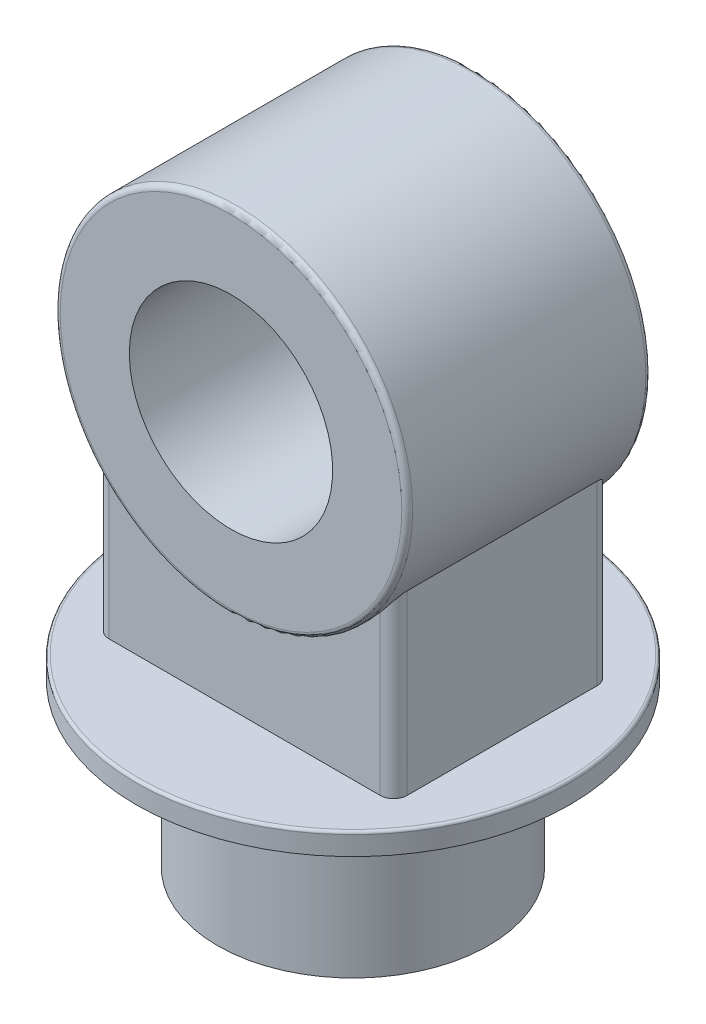
ISO-10303-21;
HEADER;
FILE_DESCRIPTION(('STEP AP214'),'2;1');
FILE_NAME('part.step','',(''),(''),'','','');
FILE_SCHEMA(('AUTOMOTIVE_DESIGN { 1 0 10303 214 1 1 1 1 }'));
ENDSEC;
DATA;
#1=APPLICATION_CONTEXT('core data for automotive mechanical design processes');
#2=APPLICATION_PROTOCOL_DEFINITION('international standard','automotive_design',2000,#1);
#3=PRODUCT_CONTEXT('',#1,'mechanical');
#4=PRODUCT('Part','Part','',(#3));
#5=PRODUCT_RELATED_PRODUCT_CATEGORY('part','',(#4));
#6=PRODUCT_DEFINITION_FORMATION('','',#4);
#7=PRODUCT_DEFINITION_CONTEXT('part definition',#1,'design');
#8=PRODUCT_DEFINITION('design','',#6,#7);
#9=PRODUCT_DEFINITION_SHAPE('','',#8);
#10=(LENGTH_UNIT() NAMED_UNIT(*) SI_UNIT(.MILLI.,.METRE.));
#11=(NAMED_UNIT(*) PLANE_ANGLE_UNIT() SI_UNIT($,.RADIAN.));
#12=(NAMED_UNIT(*) SI_UNIT($,.STERADIAN.) SOLID_ANGLE_UNIT());
#13=UNCERTAINTY_MEASURE_WITH_UNIT(LENGTH_MEASURE(1.E-05),#10,'distance_accuracy_value','');
#14=(GEOMETRIC_REPRESENTATION_CONTEXT(3) GLOBAL_UNCERTAINTY_ASSIGNED_CONTEXT((#13)) GLOBAL_UNIT_ASSIGNED_CONTEXT((#10,
#11,#12)) REPRESENTATION_CONTEXT('',''));
#15=CARTESIAN_POINT('',(0.,0.,0.));
#16=DIRECTION('',(0.,0.,1.));
#17=DIRECTION('',(1.,0.,0.));
#18=AXIS2_PLACEMENT_3D('',#15,#16,#17);
#19=CARTESIAN_POINT('',(0.,120.,0.));
#20=DIRECTION('',(0.,-1.,0.));
#21=DIRECTION('',(0.,0.,-1.));
#22=AXIS2_PLACEMENT_3D('',#19,#20,#21);
#23=CYLINDRICAL_SURFACE('',#22,100.);
#24=CARTESIAN_POINT('',(0.,120.,0.));
#25=DIRECTION('',(0.,1.,0.));
#26=DIRECTION('',(0.,0.,1.));
#27=AXIS2_PLACEMENT_3D('',#24,#25,#26);
#28=CIRCLE('',#27,100.);
#29=CARTESIAN_POINT('',(0.,120.,100.));
#30=VERTEX_POINT('',#29);
#31=EDGE_CURVE('E207',#30,#30,#28,.T.);
#32=ORIENTED_EDGE('',*,*,#31,.F.);
#33=EDGE_LOOP('',(#32));
#34=FACE_BOUND('',#33,.T.);
#35=CARTESIAN_POINT('',(0.,0.,0.));
#36=DIRECTION('',(0.,1.,0.));
#37=DIRECTION('',(0.,0.,1.));
#38=AXIS2_PLACEMENT_3D('',#35,#36,#37);
#39=CIRCLE('',#38,100.);
#40=CARTESIAN_POINT('',(0.,0.,100.));
#41=VERTEX_POINT('',#40);
#42=EDGE_CURVE('E206',#41,#41,#39,.T.);
#43=ORIENTED_EDGE('',*,*,#42,.T.);
#44=EDGE_LOOP('',(#43));
#45=FACE_BOUND('',#44,.T.);
#46=ADVANCED_FACE('F35',(#34,#45),#23,.T.);
#47=CARTESIAN_POINT('',(0.,0.,0.));
#48=DIRECTION('',(0.,1.,0.));
#49=DIRECTION('',(0.,0.,1.));
#50=AXIS2_PLACEMENT_3D('',#47,#48,#49);
#51=PLANE('',#50);
#52=ORIENTED_EDGE('',*,*,#42,.F.);
#53=EDGE_LOOP('',(#52));
#54=FACE_BOUND('',#53,.T.);
#55=ADVANCED_FACE('F242',(#54),#51,.F.);
#56=CARTESIAN_POINT('',(0.,136.,0.));
#57=DIRECTION('',(0.,-1.,0.));
#58=DIRECTION('',(0.,0.,-1.));
#59=AXIS2_PLACEMENT_3D('',#56,#57,#58);
#60=CYLINDRICAL_SURFACE('',#59,160.);
#61=CARTESIAN_POINT('',(0.,134.,0.));
#62=DIRECTION('',(0.,1.,0.));
#63=DIRECTION('',(0.,0.,1.));
#64=AXIS2_PLACEMENT_3D('',#61,#62,#63);
#65=CIRCLE('',#64,160.);
#66=CARTESIAN_POINT('',(0.,134.,160.));
#67=VERTEX_POINT('',#66);
#68=EDGE_CURVE('E215',#67,#67,#65,.F.);
#69=ORIENTED_EDGE('',*,*,#68,.T.);
#70=EDGE_LOOP('',(#69));
#71=FACE_BOUND('',#70,.T.);
#72=CARTESIAN_POINT('',(0.,120.,0.));
#73=DIRECTION('',(0.,1.,0.));
#74=DIRECTION('',(0.,0.,1.));
#75=AXIS2_PLACEMENT_3D('',#72,#73,#74);
#76=CIRCLE('',#75,160.);
#77=CARTESIAN_POINT('',(0.,120.,160.));
#78=VERTEX_POINT('',#77);
#79=EDGE_CURVE('E200',#78,#78,#76,.T.);
#80=ORIENTED_EDGE('',*,*,#79,.T.);
#81=EDGE_LOOP('',(#80));
#82=FACE_BOUND('',#81,.T.);
#83=ADVANCED_FACE('F248',(#71,#82),#60,.T.);
#84=CARTESIAN_POINT('',(0.,136.,0.));
#85=DIRECTION('',(0.,1.,0.));
#86=DIRECTION('',(0.,0.,1.));
#87=AXIS2_PLACEMENT_3D('',#84,#85,#86);
#88=PLANE('',#87);
#89=CARTESIAN_POINT('',(0.,136.,0.));
#90=DIRECTION('',(0.,1.,0.));
#91=DIRECTION('',(0.,0.,1.));
#92=AXIS2_PLACEMENT_3D('',#89,#90,#91);
#93=CIRCLE('',#92,158.);
#94=CARTESIAN_POINT('',(0.,136.,158.));
#95=VERTEX_POINT('',#94);
#96=EDGE_CURVE('E210',#95,#95,#93,.T.);
#97=ORIENTED_EDGE('',*,*,#96,.T.);
#98=EDGE_LOOP('',(#97));
#99=FACE_BOUND('',#98,.T.);
#100=DIRECTION('',(0.,0.,1.));
#101=VECTOR('',#100,1.);
#102=CARTESIAN_POINT('',(-110.,136.,80.));
#103=LINE('',#102,#101);
#104=CARTESIAN_POINT('',(-110.,136.,-69.9999999999999));
#105=VERTEX_POINT('',#104);
#106=CARTESIAN_POINT('',(-110.,136.,70.));
#107=VERTEX_POINT('',#106);
#108=EDGE_CURVE('E385',#105,#107,#103,.T.);
#109=ORIENTED_EDGE('',*,*,#108,.F.);
#110=CARTESIAN_POINT('',(-100.,136.000000000024,-69.9999999999999));
#111=DIRECTION('',(0.,1.,0.));
#112=DIRECTION('',(0.,0.,1.));
#113=AXIS2_PLACEMENT_3D('',#110,#111,#112);
#114=CIRCLE('',#113,10.);
#115=CARTESIAN_POINT('',(-100.,136.,-80.));
#116=VERTEX_POINT('',#115);
#117=EDGE_CURVE('E117',#105,#116,#114,.F.);
#118=ORIENTED_EDGE('',*,*,#117,.T.);
#119=DIRECTION('',(-1.,0.,0.));
#120=VECTOR('',#119,1.);
#121=CARTESIAN_POINT('',(110.,136.,-80.));
#122=LINE('',#121,#120);
#123=CARTESIAN_POINT('',(100.,136.,-80.));
#124=VERTEX_POINT('',#123);
#125=EDGE_CURVE('E384',#124,#116,#122,.T.);
#126=ORIENTED_EDGE('',*,*,#125,.F.);
#127=CARTESIAN_POINT('',(100.,136.000000000024,-70.));
#128=DIRECTION('',(0.,1.,0.));
#129=DIRECTION('',(0.,0.,1.));
#130=AXIS2_PLACEMENT_3D('',#127,#128,#129);
#131=CIRCLE('',#130,10.);
#132=CARTESIAN_POINT('',(110.,136.,-70.));
#133=VERTEX_POINT('',#132);
#134=EDGE_CURVE('E55',#124,#133,#131,.F.);
#135=ORIENTED_EDGE('',*,*,#134,.T.);
#136=DIRECTION('',(0.,0.,-1.));
#137=VECTOR('',#136,1.);
#138=CARTESIAN_POINT('',(110.,136.,80.));
#139=LINE('',#138,#137);
#140=CARTESIAN_POINT('',(110.,136.,70.));
#141=VERTEX_POINT('',#140);
#142=EDGE_CURVE('E184',#141,#133,#139,.T.);
#143=ORIENTED_EDGE('',*,*,#142,.F.);
#144=CARTESIAN_POINT('',(100.,136.000000000024,70.));
#145=DIRECTION('',(0.,1.,0.));
#146=DIRECTION('',(0.,0.,1.));
#147=AXIS2_PLACEMENT_3D('',#144,#145,#146);
#148=CIRCLE('',#147,10.);
#149=CARTESIAN_POINT('',(100.,136.,80.));
#150=VERTEX_POINT('',#149);
#151=EDGE_CURVE('E48',#141,#150,#148,.F.);
#152=ORIENTED_EDGE('',*,*,#151,.T.);
#153=DIRECTION('',(1.,0.,0.));
#154=VECTOR('',#153,1.);
#155=CARTESIAN_POINT('',(110.,136.,80.));
#156=LINE('',#155,#154);
#157=CARTESIAN_POINT('',(-100.,136.,80.));
#158=VERTEX_POINT('',#157);
#159=EDGE_CURVE('E128',#158,#150,#156,.T.);
#160=ORIENTED_EDGE('',*,*,#159,.F.);
#161=CARTESIAN_POINT('',(-100.,136.000000000024,70.));
#162=DIRECTION('',(0.,1.,0.));
#163=DIRECTION('',(0.,0.,1.));
#164=AXIS2_PLACEMENT_3D('',#161,#162,#163);
#165=CIRCLE('',#164,10.);
#166=EDGE_CURVE('E116',#158,#107,#165,.F.);
#167=ORIENTED_EDGE('',*,*,#166,.T.);
#168=EDGE_LOOP('',(#109,#118,#126,#135,#143,#152,#160,#167));
#169=FACE_BOUND('',#168,.T.);
#170=ADVANCED_FACE('F183',(#99,#169),#88,.T.);
#171=CARTESIAN_POINT('',(0.,120.,0.));
#172=DIRECTION('',(0.,1.,0.));
#173=DIRECTION('',(0.,0.,1.));
#174=AXIS2_PLACEMENT_3D('',#171,#172,#173);
#175=PLANE('',#174);
#176=ORIENTED_EDGE('',*,*,#31,.T.);
#177=EDGE_LOOP('',(#176));
#178=FACE_BOUND('',#177,.T.);
#179=ORIENTED_EDGE('',*,*,#79,.F.);
#180=EDGE_LOOP('',(#179));
#181=FACE_BOUND('',#180,.T.);
#182=ADVANCED_FACE('F269',(#178,#181),#175,.F.);
#183=CARTESIAN_POINT('',(110.,500000.,80.));
#184=DIRECTION('',(0.,0.,-1.));
#185=DIRECTION('',(-1.,0.,0.));
#186=AXIS2_PLACEMENT_3D('',#183,#184,#185);
#187=PLANE('',#186);
#188=CARTESIAN_POINT('',(0.,336.,80.));
#189=DIRECTION('',(0.,0.,-1.));
#190=DIRECTION('',(-1.,0.,0.));
#191=AXIS2_PLACEMENT_3D('',#188,#189,#190);
#192=CIRCLE('',#191,130.);
#193=CARTESIAN_POINT('',(-100.,252.933761370819,80.));
#194=VERTEX_POINT('',#193);
#195=CARTESIAN_POINT('',(100.,252.933761370819,80.));
#196=VERTEX_POINT('',#195);
#197=EDGE_CURVE('E127',#194,#196,#192,.F.);
#198=ORIENTED_EDGE('',*,*,#197,.F.);
#199=DIRECTION('',(0.,-1.,0.));
#200=VECTOR('',#199,1.);
#201=CARTESIAN_POINT('',(-100.,500000.,80.));
#202=LINE('',#201,#200);
#203=EDGE_CURVE('E143',#194,#158,#202,.T.);
#204=ORIENTED_EDGE('',*,*,#203,.T.);
#205=ORIENTED_EDGE('',*,*,#159,.T.);
#206=DIRECTION('',(0.,-1.,0.));
#207=VECTOR('',#206,1.);
#208=CARTESIAN_POINT('',(100.,500000.,80.));
#209=LINE('',#208,#207);
#210=EDGE_CURVE('E141',#150,#196,#209,.F.);
#211=ORIENTED_EDGE('',*,*,#210,.T.);
#212=EDGE_LOOP('',(#198,#204,#205,#211));
#213=FACE_BOUND('',#212,.T.);
#214=ADVANCED_FACE('F187',(#213),#187,.F.);
#215=CARTESIAN_POINT('',(-110.,500000.,80.));
#216=DIRECTION('',(1.,0.,0.));
#217=DIRECTION('',(0.,0.,-1.));
#218=AXIS2_PLACEMENT_3D('',#215,#216,#217);
#219=PLANE('',#218);
#220=DIRECTION('',(0.,0.,-1.));
#221=VECTOR('',#220,1.);
#222=CARTESIAN_POINT('',(-110.,266.717967697245,90.));
#223=LINE('',#222,#221);
#224=CARTESIAN_POINT('',(-110.,266.717967697245,-69.9999999999999));
#225=VERTEX_POINT('',#224);
#226=CARTESIAN_POINT('',(-110.,266.717967697245,70.0000000000001));
#227=VERTEX_POINT('',#226);
#228=EDGE_CURVE('E109',#225,#227,#223,.F.);
#229=ORIENTED_EDGE('',*,*,#228,.F.);
#230=DIRECTION('',(0.,-1.,0.));
#231=VECTOR('',#230,1.);
#232=CARTESIAN_POINT('',(-110.,500000.,-69.9999999999999));
#233=LINE('',#232,#231);
#234=EDGE_CURVE('E123',#225,#105,#233,.T.);
#235=ORIENTED_EDGE('',*,*,#234,.T.);
#236=ORIENTED_EDGE('',*,*,#108,.T.);
#237=DIRECTION('',(0.,-1.,0.));
#238=VECTOR('',#237,1.);
#239=CARTESIAN_POINT('',(-110.,500000.,70.));
#240=LINE('',#239,#238);
#241=EDGE_CURVE('E126',#107,#227,#240,.F.);
#242=ORIENTED_EDGE('',*,*,#241,.T.);
#243=EDGE_LOOP('',(#229,#235,#236,#242));
#244=FACE_BOUND('',#243,.T.);
#245=ADVANCED_FACE('F121',(#244),#219,.F.);
#246=CARTESIAN_POINT('',(110.,500000.,80.));
#247=DIRECTION('',(-1.,0.,0.));
#248=DIRECTION('',(0.,0.,1.));
#249=AXIS2_PLACEMENT_3D('',#246,#247,#248);
#250=PLANE('',#249);
#251=ORIENTED_EDGE('',*,*,#142,.T.);
#252=DIRECTION('',(0.,-1.,0.));
#253=VECTOR('',#252,1.);
#254=CARTESIAN_POINT('',(110.,500000.,-70.));
#255=LINE('',#254,#253);
#256=CARTESIAN_POINT('',(110.,266.717967697245,-69.9999999999999));
#257=VERTEX_POINT('',#256);
#258=EDGE_CURVE('E148',#133,#257,#255,.F.);
#259=ORIENTED_EDGE('',*,*,#258,.T.);
#260=DIRECTION('',(0.,0.,-1.));
#261=VECTOR('',#260,1.);
#262=CARTESIAN_POINT('',(110.,266.717967697245,90.));
#263=LINE('',#262,#261);
#264=CARTESIAN_POINT('',(110.,266.717967697245,70.));
#265=VERTEX_POINT('',#264);
#266=EDGE_CURVE('E194',#265,#257,#263,.T.);
#267=ORIENTED_EDGE('',*,*,#266,.F.);
#268=DIRECTION('',(0.,-1.,0.));
#269=VECTOR('',#268,1.);
#270=CARTESIAN_POINT('',(110.,500000.,70.));
#271=LINE('',#270,#269);
#272=EDGE_CURVE('E146',#265,#141,#271,.T.);
#273=ORIENTED_EDGE('',*,*,#272,.T.);
#274=EDGE_LOOP('',(#251,#259,#267,#273));
#275=FACE_BOUND('',#274,.T.);
#276=ADVANCED_FACE('F197',(#275),#250,.F.);
#277=CARTESIAN_POINT('',(110.,500000.,-80.));
#278=DIRECTION('',(0.,0.,1.));
#279=DIRECTION('',(1.,0.,0.));
#280=AXIS2_PLACEMENT_3D('',#277,#278,#279);
#281=PLANE('',#280);
#282=ORIENTED_EDGE('',*,*,#125,.T.);
#283=DIRECTION('',(0.,-1.,0.));
#284=VECTOR('',#283,1.);
#285=CARTESIAN_POINT('',(-100.,500000.,-80.));
#286=LINE('',#285,#284);
#287=CARTESIAN_POINT('',(-100.,252.933761370819,-79.9999999999999));
#288=VERTEX_POINT('',#287);
#289=EDGE_CURVE('E134',#116,#288,#286,.F.);
#290=ORIENTED_EDGE('',*,*,#289,.T.);
#291=CARTESIAN_POINT('',(0.,336.,-79.9999999999999));
#292=DIRECTION('',(0.,0.,1.));
#293=DIRECTION('',(1.,0.,0.));
#294=AXIS2_PLACEMENT_3D('',#291,#292,#293);
#295=CIRCLE('',#294,130.);
#296=CARTESIAN_POINT('',(100.,252.933761370819,-79.9999999999999));
#297=VERTEX_POINT('',#296);
#298=EDGE_CURVE('E112',#297,#288,#295,.F.);
#299=ORIENTED_EDGE('',*,*,#298,.F.);
#300=DIRECTION('',(0.,-1.,0.));
#301=VECTOR('',#300,1.);
#302=CARTESIAN_POINT('',(100.,500000.,-80.));
#303=LINE('',#302,#301);
#304=EDGE_CURVE('E131',#297,#124,#303,.T.);
#305=ORIENTED_EDGE('',*,*,#304,.T.);
#306=EDGE_LOOP('',(#282,#290,#299,#305));
#307=FACE_BOUND('',#306,.T.);
#308=ADVANCED_FACE('F281',(#307),#281,.F.);
#309=CARTESIAN_POINT('',(0.,336.,90.));
#310=DIRECTION('',(0.,0.,-1.));
#311=DIRECTION('',(-1.,0.,0.));
#312=AXIS2_PLACEMENT_3D('',#309,#310,#311);
#313=CYLINDRICAL_SURFACE('',#312,130.);
#314=CARTESIAN_POINT('',(0.,336.,-86.));
#315=DIRECTION('',(0.,0.,1.));
#316=DIRECTION('',(1.,0.,0.));
#317=AXIS2_PLACEMENT_3D('',#314,#315,#316);
#318=CIRCLE('',#317,130.);
#319=CARTESIAN_POINT('',(130.,336.,-86.));
#320=VERTEX_POINT('',#319);
#321=EDGE_CURVE('E221',#320,#320,#318,.T.);
#322=ORIENTED_EDGE('',*,*,#321,.T.);
#323=EDGE_LOOP('',(#322));
#324=FACE_BOUND('',#323,.T.);
#325=CARTESIAN_POINT('',(0.,336.,86.));
#326=DIRECTION('',(0.,0.,1.));
#327=DIRECTION('',(1.,0.,0.));
#328=AXIS2_PLACEMENT_3D('',#325,#326,#327);
#329=CIRCLE('',#328,130.);
#330=CARTESIAN_POINT('',(130.,336.,86.));
#331=VERTEX_POINT('',#330);
#332=EDGE_CURVE('E218',#331,#331,#329,.F.);
#333=ORIENTED_EDGE('',*,*,#332,.T.);
#334=EDGE_LOOP('',(#333));
#335=FACE_BOUND('',#334,.T.);
#336=ORIENTED_EDGE('',*,*,#298,.T.);
#337=CARTESIAN_POINT('',(-100.,252.933761370819,-80.));
#338=CARTESIAN_POINT('',(-100.223611151915,253.202952503255,-79.9999830665314));
#339=CARTESIAN_POINT('',(-100.446118360057,253.473036166024,-79.9924995885084));
#340=CARTESIAN_POINT('',(-100.888548742496,254.014496760122,-79.9629173131462));
#341=CARTESIAN_POINT('',(-101.108472043759,254.285873626978,-79.9408192370115));
#342=CARTESIAN_POINT('',(-101.545586290072,254.829711400373,-79.8822979337703));
#343=CARTESIAN_POINT('',(-101.76277446753,255.102173087004,-79.845861238523));
#344=CARTESIAN_POINT('',(-102.193849033468,255.647413797012,-79.7588609087487));
#345=CARTESIAN_POINT('',(-102.407735374993,255.920192824843,-79.7082970735216));
#346=CARTESIAN_POINT('',(-103.048408055095,256.74400885936,-79.5343891784365));
#347=CARTESIAN_POINT('',(-103.469748368072,257.294974230618,-79.3894263280957));
#348=CARTESIAN_POINT('',(-104.088382224678,258.117224843771,-79.1288060997197));
#349=CARTESIAN_POINT('',(-104.292337034927,258.39057162742,-79.0347525474724));
#350=CARTESIAN_POINT('',(-104.695498702643,258.935304765081,-78.8319429710981));
#351=CARTESIAN_POINT('',(-104.894706004332,259.206691300842,-78.7231883289498));
#352=CARTESIAN_POINT('',(-105.336170271764,259.812965668139,-78.4620472638271));
#353=CARTESIAN_POINT('',(-105.577006541077,260.147108038148,-78.3055009036512));
#354=CARTESIAN_POINT('',(-106.04966094987,260.809343252621,-77.9678086263909));
#355=CARTESIAN_POINT('',(-106.281479043935,261.137436066616,-77.7866625854443));
#356=CARTESIAN_POINT('',(-106.734152264033,261.784259610706,-77.3986376161627));
#357=CARTESIAN_POINT('',(-106.955036134368,262.103013877598,-77.1918317878756));
#358=CARTESIAN_POINT('',(-107.384708325122,262.728803605627,-76.7498943920219));
#359=CARTESIAN_POINT('',(-107.593501627276,263.035843875289,-76.5147746155491));
#360=CARTESIAN_POINT('',(-107.921279015409,263.522080966666,-76.1068757916445));
#361=CARTESIAN_POINT('',(-108.044709884718,263.706240813682,-75.9435605188262));
#362=CARTESIAN_POINT('',(-108.284949666933,264.066582834907,-75.6038296157537));
#363=CARTESIAN_POINT('',(-108.401760304956,264.242767084986,-75.4274174262628));
#364=CARTESIAN_POINT('',(-108.627683741988,264.585236991633,-75.0605773993746));
#365=CARTESIAN_POINT('',(-108.736797961361,264.751524473746,-74.8701521613912));
#366=CARTESIAN_POINT('',(-108.945874410432,265.071634412635,-74.4745306992527));
#367=CARTESIAN_POINT('',(-109.04583974995,265.225461102935,-74.2693395369045));
#368=CARTESIAN_POINT('',(-109.274660386151,265.579056080623,-73.7536743100227));
#369=CARTESIAN_POINT('',(-109.398046362816,265.771031349643,-73.4351396850742));
#370=CARTESIAN_POINT('',(-109.561336457207,266.026263049992,-72.9345418523035));
#371=CARTESIAN_POINT('',(-109.612072269395,266.105785634321,-72.7641622498836));
#372=CARTESIAN_POINT('',(-109.705421847597,266.25239837099,-72.4160328323222));
#373=CARTESIAN_POINT('',(-109.748040656091,266.319496241142,-72.2382876769632));
#374=CARTESIAN_POINT('',(-109.820262744001,266.433384610412,-71.8947331689276));
#375=CARTESIAN_POINT('',(-109.850752312767,266.481551609067,-71.729567610939));
#376=CARTESIAN_POINT('',(-109.903691363628,266.565274678988,-71.3948451418075));
#377=CARTESIAN_POINT('',(-109.926143541964,266.600834979285,-71.2252897238032));
#378=CARTESIAN_POINT('',(-109.962659042777,266.658707696818,-70.8807814271976));
#379=CARTESIAN_POINT('',(-109.976613864032,266.680848750137,-70.7057875562756));
#380=CARTESIAN_POINT('',(-109.99061964662,266.703076138542,-70.4419386674802));
#381=CARTESIAN_POINT('',(-109.99413386492,266.708654625171,-70.353690213971));
#382=CARTESIAN_POINT('',(-109.998824989492,266.716102079045,-70.1769662160101));
#383=CARTESIAN_POINT('',(-110.000001659485,266.717970671296,-70.0884906495069));
#384=CARTESIAN_POINT('',(-110.,266.717967697245,-69.9999999999999));
#385=B_SPLINE_CURVE_WITH_KNOTS('',3,(#337,#338,#339,#340,#341,#342,#343,#344,#345,#346,#347,
#348,#349,#350,#351,#352,#353,#354,#355,#356,#357,#358,#359,#360,#361,#362,#363,#364,#365,#366,
#367,#368,#369,#370,#371,#372,#373,#374,#375,#376,#377,#378,#379,#380,#381,#382,#383,#384),
.UNSPECIFIED.,.F.,.F.,(4,2,2,2,2,2,2,2,2,2,2,2,2,2,2,2,2,2,2,2,2,2,2,4),(0.,1.04974156507771,
2.09943133114567,3.15010942417266,4.20080244462031,6.32356278933855,7.38465211465323,
8.44564176134495,9.76677685539392,11.0879186017609,12.4053795382949,13.7222937149077,
14.5479419827463,15.3733741023697,16.1986534888325,17.0236513022889,18.1946866504919,
18.7783719827904,19.3616935243415,19.8852298594992,20.408590403038,20.9385006934629,
21.2038887699912,21.4693036704869),.UNSPECIFIED.);
#386=EDGE_CURVE('E106',#288,#225,#385,.T.);
#387=ORIENTED_EDGE('',*,*,#386,.T.);
#388=ORIENTED_EDGE('',*,*,#228,.T.);
#389=CARTESIAN_POINT('',(-110.,266.717967697245,70.));
#390=CARTESIAN_POINT('',(-110.000033683462,266.718025852698,70.1614230595313));
#391=CARTESIAN_POINT('',(-109.996092792414,266.711764254296,70.3228118197691));
#392=CARTESIAN_POINT('',(-109.980519982779,266.687045880384,70.6441123999958));
#393=CARTESIAN_POINT('',(-109.968896213713,266.668602027069,70.8040256031146));
#394=CARTESIAN_POINT('',(-109.938376398954,266.620217986395,71.1196424551221));
#395=CARTESIAN_POINT('',(-109.919558261622,266.590400967593,71.2753727040436));
#396=CARTESIAN_POINT('',(-109.875071558334,266.52000006118,71.5834085562727));
#397=CARTESIAN_POINT('',(-109.849400846184,266.479412800404,71.735713070425));
#398=CARTESIAN_POINT('',(-109.784772267017,266.377386983169,72.0722520040975));
#399=CARTESIAN_POINT('',(-109.744103525393,266.313281105856,72.2553511890568));
#400=CARTESIAN_POINT('',(-109.654040532803,266.17165023193,72.6141464391851));
#401=CARTESIAN_POINT('',(-109.604640075501,266.094115691273,72.7898371277865));
#402=CARTESIAN_POINT('',(-109.497968805892,265.927147418338,73.1338723913451));
#403=CARTESIAN_POINT('',(-109.440667457039,265.837667562915,73.3021849515411));
#404=CARTESIAN_POINT('',(-109.319341126161,265.648779195145,73.6304969218558));
#405=CARTESIAN_POINT('',(-109.25531768694,265.549372961282,73.7904982269664));
#406=CARTESIAN_POINT('',(-109.085069343255,265.28590129292,74.1868876463209));
#407=CARTESIAN_POINT('',(-108.974781990569,265.115997241409,74.4176642111939));
#408=CARTESIAN_POINT('',(-108.742772943656,264.76058359918,74.8607110351427));
#409=CARTESIAN_POINT('',(-108.621044869784,264.575065307649,75.072970840064));
#410=CARTESIAN_POINT('',(-108.36794946479,264.19164129378,75.4804206329535));
#411=CARTESIAN_POINT('',(-108.236568322626,263.993717884812,75.6755852518652));
#412=CARTESIAN_POINT('',(-107.965814499919,263.588382733387,76.0497203250662));
#413=CARTESIAN_POINT('',(-107.826442440892,263.380971729107,76.2286920360202));
#414=CARTESIAN_POINT('',(-107.56145650763,262.989174407744,76.5468161797373));
#415=CARTESIAN_POINT('',(-107.436764821801,262.805791987749,76.6879854690674));
#416=CARTESIAN_POINT('',(-107.182869679799,262.434497987953,76.9599552926784));
#417=CARTESIAN_POINT('',(-107.053665586411,262.24658576965,77.0907543539386));
#418=CARTESIAN_POINT('',(-106.659844344167,261.677121003612,77.4685356621902));
#419=CARTESIAN_POINT('',(-106.389102445143,261.289965080353,77.7008024816962));
#420=CARTESIAN_POINT('',(-105.833418194946,260.504836154638,78.1298636316311));
#421=CARTESIAN_POINT('',(-105.548442441802,260.106838810795,78.3265689888296));
#422=CARTESIAN_POINT('',(-104.96676628824,259.304344779382,78.6860846955172));
#423=CARTESIAN_POINT('',(-104.670068038633,258.899849292081,78.8489012287858));
#424=CARTESIAN_POINT('',(-104.024574509401,258.030646711215,79.1623550419402));
#425=CARTESIAN_POINT('',(-103.674248758637,257.565348460988,79.3081944572229));
#426=CARTESIAN_POINT('',(-102.961876677953,256.632523338709,79.558756520093));
#427=CARTESIAN_POINT('',(-102.599828734006,256.16499616738,79.6634734792563));
#428=CARTESIAN_POINT('',(-102.051092736822,255.466397204689,79.7891645729388));
#429=CARTESIAN_POINT('',(-101.868137468165,255.235094848973,79.8257282191265));
#430=CARTESIAN_POINT('',(-101.499966150616,254.77288550036,79.8886289353229));
#431=CARTESIAN_POINT('',(-101.314750133026,254.541978502041,79.9149661467555));
#432=CARTESIAN_POINT('',(-100.942320486513,254.080919722901,79.9572665465168));
#433=CARTESIAN_POINT('',(-100.755107350153,253.850767773367,79.9732322353467));
#434=CARTESIAN_POINT('',(-100.378860262163,253.391449185777,79.9945948234744));
#435=CARTESIAN_POINT('',(-100.189826234412,253.162282589497,79.9999912789888));
#436=CARTESIAN_POINT('',(-100.,252.933761370819,80.));
#437=B_SPLINE_CURVE_WITH_KNOTS('',3,(#389,#390,#391,#392,#393,#394,#395,#396,#397,#398,#399,
#400,#401,#402,#403,#404,#405,#406,#407,#408,#409,#410,#411,#412,#413,#414,#415,#416,#417,#418,
#419,#420,#421,#422,#423,#424,#425,#426,#427,#428,#429,#430,#431,#432,#433,#434,#435,#436),
.UNSPECIFIED.,.F.,.F.,(4,2,2,2,2,2,2,2,2,2,2,2,2,2,2,2,2,2,2,2,2,2,2,4),(0.,0.484045005923067,
0.967577389145411,1.44601544684507,1.92460352520313,2.51835043890468,3.11252108624077,
3.70905613988739,4.30545457926273,5.22516595363369,6.14539326092325,7.0669638228419,
7.98846280401964,8.77680092000542,9.56525081419908,11.1426900482287,12.7240229357798,
14.305067020047,16.1047501551828,17.9046821508918,18.7960435003638,19.6873925225409,
20.5785265668947,21.4696980275819),.UNSPECIFIED.);
#438=EDGE_CURVE('E171',#227,#194,#437,.T.);
#439=ORIENTED_EDGE('',*,*,#438,.T.);
#440=ORIENTED_EDGE('',*,*,#197,.T.);
#441=CARTESIAN_POINT('',(100.,252.933761370819,80.));
#442=CARTESIAN_POINT('',(100.223611151915,253.202952503255,79.9999830665315));
#443=CARTESIAN_POINT('',(100.446118360057,253.473036166024,79.9924995885085));
#444=CARTESIAN_POINT('',(100.888548742496,254.014496760122,79.9629173131463));
#445=CARTESIAN_POINT('',(101.10847204376,254.285873626978,79.9408192370116));
#446=CARTESIAN_POINT('',(101.545586290072,254.829711400373,79.8822979337703));
#447=CARTESIAN_POINT('',(101.76277446753,255.102173087004,79.8458612385231));
#448=CARTESIAN_POINT('',(102.193849033468,255.647413797012,79.7588609087488));
#449=CARTESIAN_POINT('',(102.407735374993,255.920192824843,79.7082970735217));
#450=CARTESIAN_POINT('',(103.048408055095,256.74400885936,79.5343891784366));
#451=CARTESIAN_POINT('',(103.469748368072,257.294974230618,79.3894263280958));
#452=CARTESIAN_POINT('',(104.088382224678,258.117224843771,79.1288060997198));
#453=CARTESIAN_POINT('',(104.292337034927,258.39057162742,79.0347525474725));
#454=CARTESIAN_POINT('',(104.695498702643,258.935304765081,78.8319429710982));
#455=CARTESIAN_POINT('',(104.894706004332,259.206691300842,78.7231883289499));
#456=CARTESIAN_POINT('',(105.336170271764,259.812965668139,78.4620472638272));
#457=CARTESIAN_POINT('',(105.577006541077,260.147108038148,78.3055009036513));
#458=CARTESIAN_POINT('',(106.049660949871,260.809343252621,77.967808626391));
#459=CARTESIAN_POINT('',(106.281479043935,261.137436066616,77.7866625854444));
#460=CARTESIAN_POINT('',(106.734152264033,261.784259610706,77.3986376161628));
#461=CARTESIAN_POINT('',(106.955036134368,262.103013877599,77.1918317878757));
#462=CARTESIAN_POINT('',(107.384708325122,262.728803605627,76.749894392022));
#463=CARTESIAN_POINT('',(107.593501627276,263.035843875289,76.5147746155493));
#464=CARTESIAN_POINT('',(107.921279015409,263.522080966667,76.1068757916446));
#465=CARTESIAN_POINT('',(108.044709884718,263.706240813682,75.9435605188263));
#466=CARTESIAN_POINT('',(108.284949666933,264.066582834907,75.6038296157538));
#467=CARTESIAN_POINT('',(108.401760304956,264.242767084986,75.4274174262628));
#468=CARTESIAN_POINT('',(108.627683741988,264.585236991633,75.0605773993746));
#469=CARTESIAN_POINT('',(108.736797961361,264.751524473746,74.8701521613912));
#470=CARTESIAN_POINT('',(108.945874410432,265.071634412635,74.4745306992528));
#471=CARTESIAN_POINT('',(109.04583974995,265.225461102935,74.2693395369045));
#472=CARTESIAN_POINT('',(109.274660386151,265.579056080623,73.7536743100227));
#473=CARTESIAN_POINT('',(109.398046362816,265.771031349643,73.4351396850743));
#474=CARTESIAN_POINT('',(109.561336457207,266.026263049993,72.9345418523036));
#475=CARTESIAN_POINT('',(109.612072269395,266.105785634321,72.7641622498837));
#476=CARTESIAN_POINT('',(109.705421847597,266.25239837099,72.4160328323222));
#477=CARTESIAN_POINT('',(109.748040656091,266.319496241142,72.2382876769633));
#478=CARTESIAN_POINT('',(109.820262744001,266.433384610412,71.8947331689277));
#479=CARTESIAN_POINT('',(109.850752312767,266.481551609067,71.7295676109391));
#480=CARTESIAN_POINT('',(109.903691363628,266.565274678988,71.3948451418076));
#481=CARTESIAN_POINT('',(109.926143541964,266.600834979285,71.2252897238033));
#482=CARTESIAN_POINT('',(109.962659042777,266.658707696818,70.8807814271977));
#483=CARTESIAN_POINT('',(109.976613864032,266.680848750137,70.7057875562757));
#484=CARTESIAN_POINT('',(109.99061964662,266.703076138542,70.4419386674803));
#485=CARTESIAN_POINT('',(109.99413386492,266.708654625171,70.3536902139711));
#486=CARTESIAN_POINT('',(109.998824989492,266.716102079046,70.1769662160102));
#487=CARTESIAN_POINT('',(110.000001659485,266.717970671296,70.088490649507));
#488=CARTESIAN_POINT('',(110.,266.717967697245,70.));
#489=B_SPLINE_CURVE_WITH_KNOTS('',3,(#441,#442,#443,#444,#445,#446,#447,#448,#449,#450,#451,
#452,#453,#454,#455,#456,#457,#458,#459,#460,#461,#462,#463,#464,#465,#466,#467,#468,#469,#470,
#471,#472,#473,#474,#475,#476,#477,#478,#479,#480,#481,#482,#483,#484,#485,#486,#487,#488),
.UNSPECIFIED.,.F.,.F.,(4,2,2,2,2,2,2,2,2,2,2,2,2,2,2,2,2,2,2,2,2,2,2,4),(0.,1.04974156507777,
2.09943133114574,3.15010942417272,4.20080244462032,6.32356278933858,7.38465211465327,
8.44564176134501,9.76677685539398,11.087918601761,12.4053795382949,13.7222937149077,
14.5479419827464,15.3733741023698,16.1986534888326,17.023651302289,18.194686650492,
18.7783719827905,19.3616935243415,19.8852298594992,20.408590403038,20.9385006934629,
21.2038887699912,21.4693036704869),.UNSPECIFIED.);
#490=EDGE_CURVE('E11',#196,#265,#489,.T.);
#491=ORIENTED_EDGE('',*,*,#490,.T.);
#492=ORIENTED_EDGE('',*,*,#266,.T.);
#493=CARTESIAN_POINT('',(110.,266.717967697245,-70.));
#494=CARTESIAN_POINT('',(110.000033683462,266.718025852698,-70.1614230595313));
#495=CARTESIAN_POINT('',(109.996092792414,266.711764254296,-70.3228118197691));
#496=CARTESIAN_POINT('',(109.980519982779,266.687045880384,-70.6441123999957));
#497=CARTESIAN_POINT('',(109.968896213713,266.668602027069,-70.8040256031146));
#498=CARTESIAN_POINT('',(109.938376398954,266.620217986395,-71.119642455122));
#499=CARTESIAN_POINT('',(109.919558261622,266.590400967593,-71.2753727040436));
#500=CARTESIAN_POINT('',(109.875071558334,266.52000006118,-71.5834085562726));
#501=CARTESIAN_POINT('',(109.849400846184,266.479412800404,-71.7357130704249));
#502=CARTESIAN_POINT('',(109.784772267017,266.377386983169,-72.0722520040974));
#503=CARTESIAN_POINT('',(109.744103525393,266.313281105856,-72.2553511890568));
#504=CARTESIAN_POINT('',(109.654040532803,266.17165023193,-72.6141464391851));
#505=CARTESIAN_POINT('',(109.604640075501,266.094115691273,-72.7898371277864));
#506=CARTESIAN_POINT('',(109.497968805892,265.927147418338,-73.133872391345));
#507=CARTESIAN_POINT('',(109.440667457039,265.837667562915,-73.302184951541));
#508=CARTESIAN_POINT('',(109.319341126161,265.648779195145,-73.6304969218558));
#509=CARTESIAN_POINT('',(109.25531768694,265.549372961282,-73.7904982269663));
#510=CARTESIAN_POINT('',(109.085069343255,265.28590129292,-74.1868876463209));
#511=CARTESIAN_POINT('',(108.974781990569,265.115997241409,-74.4176642111939));
#512=CARTESIAN_POINT('',(108.742772943656,264.76058359918,-74.8607110351426));
#513=CARTESIAN_POINT('',(108.621044869784,264.575065307649,-75.0729708400639));
#514=CARTESIAN_POINT('',(108.36794946479,264.19164129378,-75.4804206329534));
#515=CARTESIAN_POINT('',(108.236568322626,263.993717884812,-75.6755852518652));
#516=CARTESIAN_POINT('',(107.965814499919,263.588382733388,-76.0497203250661));
#517=CARTESIAN_POINT('',(107.826442440892,263.380971729107,-76.2286920360201));
#518=CARTESIAN_POINT('',(107.56145650763,262.989174407744,-76.5468161797372));
#519=CARTESIAN_POINT('',(107.436764821801,262.805791987749,-76.6879854690673));
#520=CARTESIAN_POINT('',(107.182869679799,262.434497987953,-76.9599552926783));
#521=CARTESIAN_POINT('',(107.053665586411,262.24658576965,-77.0907543539385));
#522=CARTESIAN_POINT('',(106.659844344167,261.677121003612,-77.4685356621901));
#523=CARTESIAN_POINT('',(106.389102445143,261.289965080353,-77.700802481696));
#524=CARTESIAN_POINT('',(105.833418194947,260.504836154638,-78.1298636316309));
#525=CARTESIAN_POINT('',(105.548442441802,260.106838810795,-78.3265689888295));
#526=CARTESIAN_POINT('',(104.96676628824,259.304344779382,-78.6860846955171));
#527=CARTESIAN_POINT('',(104.670068038633,258.899849292081,-78.8489012287858));
#528=CARTESIAN_POINT('',(104.024574509401,258.030646711215,-79.1623550419401));
#529=CARTESIAN_POINT('',(103.674248758637,257.565348460988,-79.3081944572228));
#530=CARTESIAN_POINT('',(102.961876677953,256.632523338709,-79.5587565200929));
#531=CARTESIAN_POINT('',(102.599828734006,256.16499616738,-79.6634734792563));
#532=CARTESIAN_POINT('',(102.051092736822,255.46639720469,-79.7891645729387));
#533=CARTESIAN_POINT('',(101.868137468165,255.235094848973,-79.8257282191264));
#534=CARTESIAN_POINT('',(101.499966150616,254.772885500361,-79.8886289353229));
#535=CARTESIAN_POINT('',(101.314750133026,254.541978502041,-79.9149661467554));
#536=CARTESIAN_POINT('',(100.942320486513,254.080919722901,-79.9572665465167));
#537=CARTESIAN_POINT('',(100.755107350153,253.850767773368,-79.9732322353467));
#538=CARTESIAN_POINT('',(100.378860262163,253.391449185777,-79.9945948234744));
#539=CARTESIAN_POINT('',(100.189826234412,253.162282589497,-79.9999912789888));
#540=CARTESIAN_POINT('',(100.,252.933761370819,-80.));
#541=B_SPLINE_CURVE_WITH_KNOTS('',3,(#493,#494,#495,#496,#497,#498,#499,#500,#501,#502,#503,
#504,#505,#506,#507,#508,#509,#510,#511,#512,#513,#514,#515,#516,#517,#518,#519,#520,#521,#522,
#523,#524,#525,#526,#527,#528,#529,#530,#531,#532,#533,#534,#535,#536,#537,#538,#539,#540),
.UNSPECIFIED.,.F.,.F.,(4,2,2,2,2,2,2,2,2,2,2,2,2,2,2,2,2,2,2,2,2,2,2,4),(0.,0.484045005923084,
0.967577389145406,1.44601544684507,1.92460352520313,2.51835043890465,3.11252108624072,
3.70905613988738,4.30545457926269,5.22516595363368,6.14539326092323,7.0669638228419,
7.98846280401961,8.7768009200054,9.56525081419892,11.1426900482286,12.7240229357797,
14.3050670200469,16.1047501551827,17.9046821508916,18.7960435003636,19.6873925225408,
20.5785265668947,21.4696980275819),.UNSPECIFIED.);
#542=EDGE_CURVE('E177',#257,#297,#541,.T.);
#543=ORIENTED_EDGE('',*,*,#542,.T.);
#544=EDGE_LOOP('',(#336,#387,#388,#439,#440,#491,#492,#543));
#545=FACE_BOUND('',#544,.T.);
#546=ADVANCED_FACE('F108',(#324,#335,#545),#313,.T.);
#547=CARTESIAN_POINT('',(0.,336.,90.));
#548=DIRECTION('',(0.,0.,1.));
#549=DIRECTION('',(1.,0.,0.));
#550=AXIS2_PLACEMENT_3D('',#547,#548,#549);
#551=PLANE('',#550);
#552=CARTESIAN_POINT('',(0.,336.,90.));
#553=DIRECTION('',(0.,0.,1.));
#554=DIRECTION('',(1.,0.,0.));
#555=AXIS2_PLACEMENT_3D('',#552,#553,#554);
#556=CIRCLE('',#555,126.);
#557=CARTESIAN_POINT('',(126.,336.,90.));
#558=VERTEX_POINT('',#557);
#559=EDGE_CURVE('E136',#558,#558,#556,.T.);
#560=ORIENTED_EDGE('',*,*,#559,.T.);
#561=EDGE_LOOP('',(#560));
#562=FACE_BOUND('',#561,.T.);
#563=CARTESIAN_POINT('',(0.,336.,90.));
#564=DIRECTION('',(0.,0.,1.));
#565=DIRECTION('',(1.,0.,0.));
#566=AXIS2_PLACEMENT_3D('',#563,#564,#565);
#567=CIRCLE('',#566,75.);
#568=CARTESIAN_POINT('',(-75.,336.,90.));
#569=VERTEX_POINT('',#568);
#570=EDGE_CURVE('E388',#569,#569,#567,.T.);
#571=ORIENTED_EDGE('',*,*,#570,.F.);
#572=EDGE_LOOP('',(#571));
#573=FACE_BOUND('',#572,.T.);
#574=ADVANCED_FACE('F229',(#562,#573),#551,.T.);
#575=CARTESIAN_POINT('',(0.,336.,-90.));
#576=DIRECTION('',(0.,0.,1.));
#577=DIRECTION('',(1.,0.,0.));
#578=AXIS2_PLACEMENT_3D('',#575,#576,#577);
#579=PLANE('',#578);
#580=CARTESIAN_POINT('',(0.,336.,-90.));
#581=DIRECTION('',(0.,0.,1.));
#582=DIRECTION('',(1.,0.,0.));
#583=AXIS2_PLACEMENT_3D('',#580,#581,#582);
#584=CIRCLE('',#583,126.);
#585=CARTESIAN_POINT('',(126.,336.,-90.));
#586=VERTEX_POINT('',#585);
#587=EDGE_CURVE('E224',#586,#586,#584,.F.);
#588=ORIENTED_EDGE('',*,*,#587,.T.);
#589=EDGE_LOOP('',(#588));
#590=FACE_BOUND('',#589,.T.);
#591=CARTESIAN_POINT('',(0.,336.,-90.));
#592=DIRECTION('',(0.,0.,1.));
#593=DIRECTION('',(1.,0.,0.));
#594=AXIS2_PLACEMENT_3D('',#591,#592,#593);
#595=CIRCLE('',#594,75.);
#596=CARTESIAN_POINT('',(-75.,336.,-90.));
#597=VERTEX_POINT('',#596);
#598=EDGE_CURVE('E391',#597,#597,#595,.T.);
#599=ORIENTED_EDGE('',*,*,#598,.T.);
#600=EDGE_LOOP('',(#599));
#601=FACE_BOUND('',#600,.T.);
#602=ADVANCED_FACE('F261',(#590,#601),#579,.F.);
#603=CARTESIAN_POINT('',(0.,336.,90.));
#604=DIRECTION('',(0.,0.,-1.));
#605=DIRECTION('',(-1.,0.,0.));
#606=AXIS2_PLACEMENT_3D('',#603,#604,#605);
#607=CYLINDRICAL_SURFACE('',#606,75.);
#608=CARTESIAN_POINT('',(-75.,336.,90.));
#609=CARTESIAN_POINT('',(-75.,336.,88.125));
#610=CARTESIAN_POINT('',(-75.,336.,86.25));
#611=CARTESIAN_POINT('',(-75.,336.,82.5));
#612=CARTESIAN_POINT('',(-75.,336.,80.625));
#613=CARTESIAN_POINT('',(-75.,336.,76.875));
#614=CARTESIAN_POINT('',(-75.,336.,75.));
#615=CARTESIAN_POINT('',(-75.,336.,71.25));
#616=CARTESIAN_POINT('',(-75.,336.,69.375));
#617=CARTESIAN_POINT('',(-75.,336.,65.625));
#618=CARTESIAN_POINT('',(-75.,336.,63.75));
#619=CARTESIAN_POINT('',(-75.,336.,60.));
#620=CARTESIAN_POINT('',(-75.,336.,58.125));
#621=CARTESIAN_POINT('',(-75.,336.,54.375));
#622=CARTESIAN_POINT('',(-75.,336.,52.5));
#623=CARTESIAN_POINT('',(-75.,336.,48.75));
#624=CARTESIAN_POINT('',(-75.,336.,46.875));
#625=CARTESIAN_POINT('',(-75.,336.,43.125));
#626=CARTESIAN_POINT('',(-75.,336.,41.25));
#627=CARTESIAN_POINT('',(-75.,336.,37.5));
#628=CARTESIAN_POINT('',(-75.,336.,35.625));
#629=CARTESIAN_POINT('',(-75.,336.,31.875));
#630=CARTESIAN_POINT('',(-75.,336.,30.));
#631=CARTESIAN_POINT('',(-75.,336.,26.25));
#632=CARTESIAN_POINT('',(-75.,336.,24.375));
#633=CARTESIAN_POINT('',(-75.,336.,20.625));
#634=CARTESIAN_POINT('',(-75.,336.,18.75));
#635=CARTESIAN_POINT('',(-75.,336.,15.));
#636=CARTESIAN_POINT('',(-75.,336.,13.125));
#637=CARTESIAN_POINT('',(-75.,336.,9.37499999999998));
#638=CARTESIAN_POINT('',(-75.,336.,7.49999999999998));
#639=CARTESIAN_POINT('',(-75.,336.,3.74999999999998));
#640=CARTESIAN_POINT('',(-75.,336.,1.87499999999997));
#641=CARTESIAN_POINT('',(-75.,336.,-1.87500000000003));
#642=CARTESIAN_POINT('',(-75.,336.,-3.75000000000003));
#643=CARTESIAN_POINT('',(-75.,336.,-7.50000000000003));
#644=CARTESIAN_POINT('',(-75.,336.,-9.37500000000004));
#645=CARTESIAN_POINT('',(-75.,336.,-13.125));
#646=CARTESIAN_POINT('',(-75.,336.,-15.));
#647=CARTESIAN_POINT('',(-75.,336.,-18.75));
#648=CARTESIAN_POINT('',(-75.,336.,-20.625));
#649=CARTESIAN_POINT('',(-75.,336.,-24.375));
#650=CARTESIAN_POINT('',(-75.,336.,-26.25));
#651=CARTESIAN_POINT('',(-75.,336.,-30.));
#652=CARTESIAN_POINT('',(-75.,336.,-31.875));
#653=CARTESIAN_POINT('',(-75.,336.,-35.625));
#654=CARTESIAN_POINT('',(-75.,336.,-37.5));
#655=CARTESIAN_POINT('',(-75.,336.,-41.25));
#656=CARTESIAN_POINT('',(-75.,336.,-43.125));
#657=CARTESIAN_POINT('',(-75.,336.,-46.875));
#658=CARTESIAN_POINT('',(-75.,336.,-48.75));
#659=CARTESIAN_POINT('',(-75.,336.,-52.5));
#660=CARTESIAN_POINT('',(-75.,336.,-54.375));
#661=CARTESIAN_POINT('',(-75.,336.,-58.125));
#662=CARTESIAN_POINT('',(-75.,336.,-60.));
#663=CARTESIAN_POINT('',(-75.,336.,-63.75));
#664=CARTESIAN_POINT('',(-75.,336.,-65.625));
#665=CARTESIAN_POINT('',(-75.,336.,-69.375));
#666=CARTESIAN_POINT('',(-75.,336.,-71.25));
#667=CARTESIAN_POINT('',(-75.,336.,-75.));
#668=CARTESIAN_POINT('',(-75.,336.,-76.875));
#669=CARTESIAN_POINT('',(-75.,336.,-80.625));
#670=CARTESIAN_POINT('',(-75.,336.,-82.5));
#671=CARTESIAN_POINT('',(-75.,336.,-86.25));
#672=CARTESIAN_POINT('',(-75.,336.,-88.125));
#673=CARTESIAN_POINT('',(-75.,336.,-90.));
#674=B_SPLINE_CURVE_WITH_KNOTS('',3,(#608,#609,#610,#611,#612,#613,#614,#615,#616,#617,#618,
#619,#620,#621,#622,#623,#624,#625,#626,#627,#628,#629,#630,#631,#632,#633,#634,#635,#636,#637,
#638,#639,#640,#641,#642,#643,#644,#645,#646,#647,#648,#649,#650,#651,#652,#653,#654,#655,#656,
#657,#658,#659,#660,#661,#662,#663,#664,#665,#666,#667,#668,#669,#670,#671,#672,#673),
.UNSPECIFIED.,.F.,.F.,(4,2,2,2,2,2,2,2,2,2,2,2,2,2,2,2,2,2,2,2,2,2,2,2,2,2,2,2,2,2,2,2,4),(0.,
5.62499999999999,11.25,16.875,22.5,28.125,33.75,39.375,45.,50.625,56.25,61.875,67.5,73.125,
78.75,84.375,90.,95.625,101.25,106.875,112.5,118.125,123.75,129.375,135.,140.625,146.25,151.875,
157.5,163.125,168.75,174.375,180.),.UNSPECIFIED.);
#675=EDGE_CURVE('BSEAM256',#569,#597,#674,.T.);
#676=ORIENTED_EDGE('',*,*,#570,.T.);
#677=ORIENTED_EDGE('',*,*,#598,.F.);
#678=ORIENTED_EDGE('',*,*,#675,.T.);
#679=ORIENTED_EDGE('',*,*,#675,.F.);
#680=EDGE_LOOP('',(#676,#678,#677,#679));
#681=FACE_BOUND('',#680,.T.);
#682=ADVANCED_FACE('F256',(#681),#607,.F.);
#683=CARTESIAN_POINT('',(0.,134.,0.));
#684=DIRECTION('',(0.,1.,0.));
#685=DIRECTION('',(0.,0.,1.));
#686=AXIS2_PLACEMENT_3D('',#683,#684,#685);
#687=TOROIDAL_SURFACE('',#686,158.,2.);
#688=ORIENTED_EDGE('',*,*,#68,.F.);
#689=EDGE_LOOP('',(#688));
#690=FACE_BOUND('',#689,.T.);
#691=ORIENTED_EDGE('',*,*,#96,.F.);
#692=EDGE_LOOP('',(#691));
#693=FACE_BOUND('',#692,.T.);
#694=ADVANCED_FACE('F238',(#690,#693),#687,.T.);
#695=CARTESIAN_POINT('',(0.,336.,-86.));
#696=DIRECTION('',(0.,0.,1.));
#697=DIRECTION('',(1.,0.,0.));
#698=AXIS2_PLACEMENT_3D('',#695,#696,#697);
#699=TOROIDAL_SURFACE('',#698,126.,4.);
#700=ORIENTED_EDGE('',*,*,#587,.F.);
#701=EDGE_LOOP('',(#700));
#702=FACE_BOUND('',#701,.T.);
#703=ORIENTED_EDGE('',*,*,#321,.F.);
#704=EDGE_LOOP('',(#703));
#705=FACE_BOUND('',#704,.T.);
#706=ADVANCED_FACE('F233',(#702,#705),#699,.T.);
#707=CARTESIAN_POINT('',(0.,336.,86.));
#708=DIRECTION('',(0.,0.,1.));
#709=DIRECTION('',(1.,0.,0.));
#710=AXIS2_PLACEMENT_3D('',#707,#708,#709);
#711=TOROIDAL_SURFACE('',#710,126.,4.);
#712=ORIENTED_EDGE('',*,*,#332,.F.);
#713=EDGE_LOOP('',(#712));
#714=FACE_BOUND('',#713,.T.);
#715=ORIENTED_EDGE('',*,*,#559,.F.);
#716=EDGE_LOOP('',(#715));
#717=FACE_BOUND('',#716,.T.);
#718=ADVANCED_FACE('F164',(#714,#717),#711,.T.);
#719=CARTESIAN_POINT('',(-100.,500000.,-69.9999999999999));
#720=DIRECTION('',(0.,-1.,0.));
#721=DIRECTION('',(0.,0.,-1.));
#722=AXIS2_PLACEMENT_3D('',#719,#720,#721);
#723=CYLINDRICAL_SURFACE('',#722,10.);
#724=ORIENTED_EDGE('',*,*,#386,.F.);
#725=ORIENTED_EDGE('',*,*,#289,.F.);
#726=ORIENTED_EDGE('',*,*,#117,.F.);
#727=ORIENTED_EDGE('',*,*,#234,.F.);
#728=EDGE_LOOP('',(#724,#725,#726,#727));
#729=FACE_BOUND('',#728,.T.);
#730=ADVANCED_FACE('F130',(#729),#723,.T.);
#731=CARTESIAN_POINT('',(-100.,500000.,70.));
#732=DIRECTION('',(0.,-1.,0.));
#733=DIRECTION('',(0.,0.,-1.));
#734=AXIS2_PLACEMENT_3D('',#731,#732,#733);
#735=CYLINDRICAL_SURFACE('',#734,10.);
#736=ORIENTED_EDGE('',*,*,#438,.F.);
#737=ORIENTED_EDGE('',*,*,#241,.F.);
#738=ORIENTED_EDGE('',*,*,#166,.F.);
#739=ORIENTED_EDGE('',*,*,#203,.F.);
#740=EDGE_LOOP('',(#736,#737,#738,#739));
#741=FACE_BOUND('',#740,.T.);
#742=ADVANCED_FACE('F163',(#741),#735,.T.);
#743=CARTESIAN_POINT('',(100.,500000.,-70.));
#744=DIRECTION('',(0.,-1.,0.));
#745=DIRECTION('',(0.,0.,-1.));
#746=AXIS2_PLACEMENT_3D('',#743,#744,#745);
#747=CYLINDRICAL_SURFACE('',#746,10.);
#748=ORIENTED_EDGE('',*,*,#542,.F.);
#749=ORIENTED_EDGE('',*,*,#258,.F.);
#750=ORIENTED_EDGE('',*,*,#134,.F.);
#751=ORIENTED_EDGE('',*,*,#304,.F.);
#752=EDGE_LOOP('',(#748,#749,#750,#751));
#753=FACE_BOUND('',#752,.T.);
#754=ADVANCED_FACE('F168',(#753),#747,.T.);
#755=CARTESIAN_POINT('',(100.,500000.,70.));
#756=DIRECTION('',(0.,-1.,0.));
#757=DIRECTION('',(0.,0.,-1.));
#758=AXIS2_PLACEMENT_3D('',#755,#756,#757);
#759=CYLINDRICAL_SURFACE('',#758,10.);
#760=ORIENTED_EDGE('',*,*,#490,.F.);
#761=ORIENTED_EDGE('',*,*,#210,.F.);
#762=ORIENTED_EDGE('',*,*,#151,.F.);
#763=ORIENTED_EDGE('',*,*,#272,.F.);
#764=EDGE_LOOP('',(#760,#761,#762,#763));
#765=FACE_BOUND('',#764,.T.);
#766=ADVANCED_FACE('F37',(#765),#759,.T.);
#767=CLOSED_SHELL('',(#46,#55,#83,#170,#182,#214,#245,#276,#308,#546,#574,#602,#682,#694,#706,
#718,#730,#742,#754,#766));
#768=MANIFOLD_SOLID_BREP('B2',#767);
#769=ADVANCED_BREP_SHAPE_REPRESENTATION('',(#18,#768),#14);
#770=SHAPE_DEFINITION_REPRESENTATION(#9,#769);
ENDSEC;
END-ISO-10303-21;
